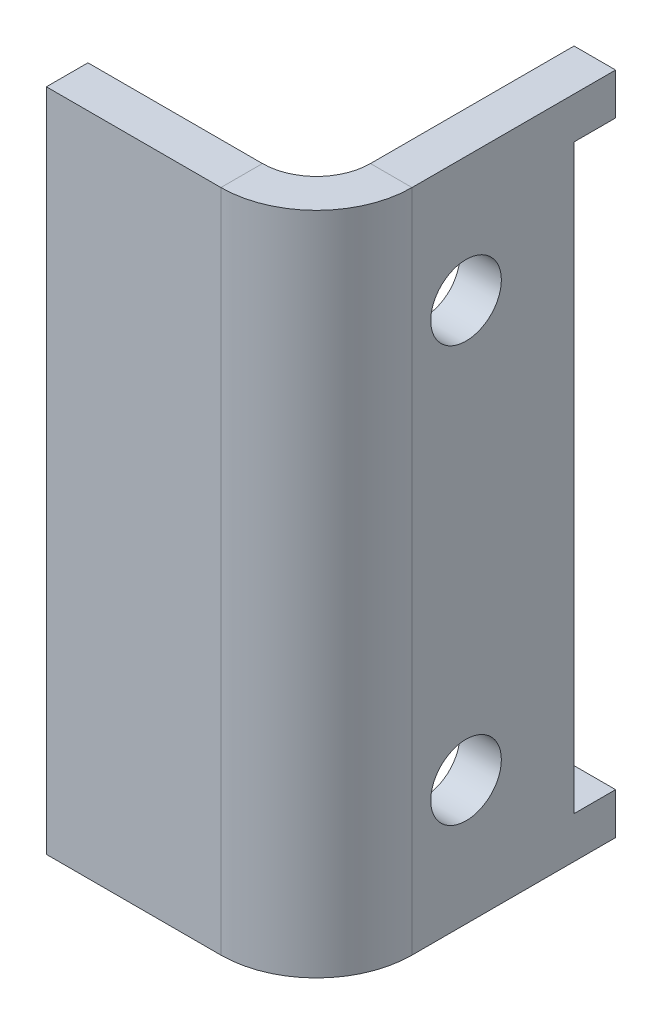
ISO-10303-21;
HEADER;
FILE_DESCRIPTION(('STEP AP214'),'2;1');
FILE_NAME('part.step','',(''),(''),'','','');
FILE_SCHEMA(('AUTOMOTIVE_DESIGN { 1 0 10303 214 1 1 1 1 }'));
ENDSEC;
DATA;
#1=APPLICATION_CONTEXT('core data for automotive mechanical design processes');
#2=APPLICATION_PROTOCOL_DEFINITION('international standard','automotive_design',2000,#1);
#3=PRODUCT_CONTEXT('',#1,'mechanical');
#4=PRODUCT('Part','Part','',(#3));
#5=PRODUCT_RELATED_PRODUCT_CATEGORY('part','',(#4));
#6=PRODUCT_DEFINITION_FORMATION('','',#4);
#7=PRODUCT_DEFINITION_CONTEXT('part definition',#1,'design');
#8=PRODUCT_DEFINITION('design','',#6,#7);
#9=PRODUCT_DEFINITION_SHAPE('','',#8);
#10=(LENGTH_UNIT() NAMED_UNIT(*) SI_UNIT(.MILLI.,.METRE.));
#11=(NAMED_UNIT(*) PLANE_ANGLE_UNIT() SI_UNIT($,.RADIAN.));
#12=(NAMED_UNIT(*) SI_UNIT($,.STERADIAN.) SOLID_ANGLE_UNIT());
#13=UNCERTAINTY_MEASURE_WITH_UNIT(LENGTH_MEASURE(1.E-05),#10,'distance_accuracy_value','');
#14=(GEOMETRIC_REPRESENTATION_CONTEXT(3) GLOBAL_UNCERTAINTY_ASSIGNED_CONTEXT((#13)) GLOBAL_UNIT_ASSIGNED_CONTEXT((#10,
#11,#12)) REPRESENTATION_CONTEXT('',''));
#15=CARTESIAN_POINT('',(0.,0.,0.));
#16=DIRECTION('',(0.,0.,1.));
#17=DIRECTION('',(1.,0.,0.));
#18=AXIS2_PLACEMENT_3D('',#15,#16,#17);
#19=CARTESIAN_POINT('',(0.,-80.,0.));
#20=DIRECTION('',(0.,1.,0.));
#21=DIRECTION('',(0.,0.,-1.));
#22=AXIS2_PLACEMENT_3D('',#19,#20,#21);
#23=PLANE('',#22);
#24=DIRECTION('',(1.,0.,0.));
#25=VECTOR('',#24,1.);
#26=CARTESIAN_POINT('',(0.,-80.,-23.));
#27=LINE('',#26,#25);
#28=CARTESIAN_POINT('',(-10.,-80.,-23.));
#29=VERTEX_POINT('',#28);
#30=CARTESIAN_POINT('',(0.,-80.,-23.));
#31=VERTEX_POINT('',#30);
#32=EDGE_CURVE('E11',#29,#31,#27,.T.);
#33=ORIENTED_EDGE('',*,*,#32,.F.);
#34=DIRECTION('',(0.,0.,1.));
#35=VECTOR('',#34,1.);
#36=CARTESIAN_POINT('',(-10.,-80.,0.));
#37=LINE('',#36,#35);
#38=CARTESIAN_POINT('',(-10.,-80.,-72.));
#39=VERTEX_POINT('',#38);
#40=EDGE_CURVE('E147',#29,#39,#37,.F.);
#41=ORIENTED_EDGE('',*,*,#40,.T.);
#42=DIRECTION('',(1.,0.,0.));
#43=VECTOR('',#42,1.);
#44=CARTESIAN_POINT('',(0.,-80.,-72.));
#45=LINE('',#44,#43);
#46=CARTESIAN_POINT('',(0.,-80.,-72.));
#47=VERTEX_POINT('',#46);
#48=EDGE_CURVE('E54',#39,#47,#45,.T.);
#49=ORIENTED_EDGE('',*,*,#48,.T.);
#50=DIRECTION('',(0.,0.,-1.));
#51=VECTOR('',#50,1.);
#52=CARTESIAN_POINT('',(0.,-80.,0.));
#53=LINE('',#52,#51);
#54=EDGE_CURVE('E230',#31,#47,#53,.T.);
#55=ORIENTED_EDGE('',*,*,#54,.F.);
#56=EDGE_LOOP('',(#33,#41,#49,#55));
#57=FACE_BOUND('',#56,.T.);
#58=ADVANCED_FACE('F43',(#57),#23,.F.);
#59=CARTESIAN_POINT('',(0.,80.,-72.));
#60=DIRECTION('',(0.,0.,-1.));
#61=DIRECTION('',(0.,-1.,0.));
#62=AXIS2_PLACEMENT_3D('',#59,#60,#61);
#63=PLANE('',#62);
#64=ORIENTED_EDGE('',*,*,#48,.F.);
#65=DIRECTION('',(0.,1.,0.));
#66=VECTOR('',#65,1.);
#67=CARTESIAN_POINT('',(-10.,80.,-72.));
#68=LINE('',#67,#66);
#69=CARTESIAN_POINT('',(-10.,-70.,-72.));
#70=VERTEX_POINT('',#69);
#71=EDGE_CURVE('E182',#70,#39,#68,.F.);
#72=ORIENTED_EDGE('',*,*,#71,.F.);
#73=DIRECTION('',(1.,0.,0.));
#74=VECTOR('',#73,1.);
#75=CARTESIAN_POINT('',(0.,-70.,-72.));
#76=LINE('',#75,#74);
#77=CARTESIAN_POINT('',(0.,-70.,-72.));
#78=VERTEX_POINT('',#77);
#79=EDGE_CURVE('E221',#70,#78,#76,.T.);
#80=ORIENTED_EDGE('',*,*,#79,.T.);
#81=DIRECTION('',(0.,-1.,0.));
#82=VECTOR('',#81,1.);
#83=CARTESIAN_POINT('',(0.,80.,-72.));
#84=LINE('',#83,#82);
#85=EDGE_CURVE('E243',#78,#47,#84,.T.);
#86=ORIENTED_EDGE('',*,*,#85,.T.);
#87=EDGE_LOOP('',(#64,#72,#80,#86));
#88=FACE_BOUND('',#87,.T.);
#89=ADVANCED_FACE('F251',(#88),#63,.T.);
#90=CARTESIAN_POINT('',(0.,-70.,-72.));
#91=DIRECTION('',(0.,1.,0.));
#92=DIRECTION('',(0.,0.,-1.));
#93=AXIS2_PLACEMENT_3D('',#90,#91,#92);
#94=PLANE('',#93);
#95=ORIENTED_EDGE('',*,*,#79,.F.);
#96=DIRECTION('',(0.,0.,1.));
#97=VECTOR('',#96,1.);
#98=CARTESIAN_POINT('',(-10.,-70.,0.));
#99=LINE('',#98,#97);
#100=CARTESIAN_POINT('',(-10.,-70.,-62.));
#101=VERTEX_POINT('',#100);
#102=EDGE_CURVE('E178',#101,#70,#99,.F.);
#103=ORIENTED_EDGE('',*,*,#102,.F.);
#104=DIRECTION('',(1.,0.,0.));
#105=VECTOR('',#104,1.);
#106=CARTESIAN_POINT('',(0.,-70.,-62.));
#107=LINE('',#106,#105);
#108=CARTESIAN_POINT('',(0.,-70.,-62.));
#109=VERTEX_POINT('',#108);
#110=EDGE_CURVE('E217',#101,#109,#107,.T.);
#111=ORIENTED_EDGE('',*,*,#110,.T.);
#112=DIRECTION('',(0.,0.,-1.));
#113=VECTOR('',#112,1.);
#114=CARTESIAN_POINT('',(0.,-70.,-72.));
#115=LINE('',#114,#113);
#116=EDGE_CURVE('E253',#109,#78,#115,.T.);
#117=ORIENTED_EDGE('',*,*,#116,.T.);
#118=EDGE_LOOP('',(#95,#103,#111,#117));
#119=FACE_BOUND('',#118,.T.);
#120=ADVANCED_FACE('F377',(#119),#94,.T.);
#121=CARTESIAN_POINT('',(0.,70.,-62.));
#122=DIRECTION('',(0.,0.,-1.));
#123=DIRECTION('',(0.,-1.,0.));
#124=AXIS2_PLACEMENT_3D('',#121,#122,#123);
#125=PLANE('',#124);
#126=ORIENTED_EDGE('',*,*,#110,.F.);
#127=DIRECTION('',(0.,1.,0.));
#128=VECTOR('',#127,1.);
#129=CARTESIAN_POINT('',(-10.,80.,-62.));
#130=LINE('',#129,#128);
#131=CARTESIAN_POINT('',(-10.,70.,-62.));
#132=VERTEX_POINT('',#131);
#133=EDGE_CURVE('E174',#132,#101,#130,.F.);
#134=ORIENTED_EDGE('',*,*,#133,.F.);
#135=DIRECTION('',(1.,0.,0.));
#136=VECTOR('',#135,1.);
#137=CARTESIAN_POINT('',(0.,70.,-62.));
#138=LINE('',#137,#136);
#139=CARTESIAN_POINT('',(0.,70.,-62.));
#140=VERTEX_POINT('',#139);
#141=EDGE_CURVE('E213',#132,#140,#138,.T.);
#142=ORIENTED_EDGE('',*,*,#141,.T.);
#143=DIRECTION('',(0.,-1.,0.));
#144=VECTOR('',#143,1.);
#145=CARTESIAN_POINT('',(0.,70.,-62.));
#146=LINE('',#145,#144);
#147=EDGE_CURVE('E260',#140,#109,#146,.T.);
#148=ORIENTED_EDGE('',*,*,#147,.T.);
#149=EDGE_LOOP('',(#126,#134,#142,#148));
#150=FACE_BOUND('',#149,.T.);
#151=ADVANCED_FACE('F343',(#150),#125,.T.);
#152=CARTESIAN_POINT('',(0.,70.,-72.));
#153=DIRECTION('',(0.,-1.,0.));
#154=DIRECTION('',(0.,0.,1.));
#155=AXIS2_PLACEMENT_3D('',#152,#153,#154);
#156=PLANE('',#155);
#157=ORIENTED_EDGE('',*,*,#141,.F.);
#158=DIRECTION('',(0.,0.,1.));
#159=VECTOR('',#158,1.);
#160=CARTESIAN_POINT('',(-10.,70.,0.));
#161=LINE('',#160,#159);
#162=CARTESIAN_POINT('',(-10.,70.,-72.));
#163=VERTEX_POINT('',#162);
#164=EDGE_CURVE('E170',#163,#132,#161,.T.);
#165=ORIENTED_EDGE('',*,*,#164,.F.);
#166=DIRECTION('',(1.,0.,0.));
#167=VECTOR('',#166,1.);
#168=CARTESIAN_POINT('',(0.,70.,-72.));
#169=LINE('',#168,#167);
#170=CARTESIAN_POINT('',(0.,70.,-72.));
#171=VERTEX_POINT('',#170);
#172=EDGE_CURVE('E209',#163,#171,#169,.T.);
#173=ORIENTED_EDGE('',*,*,#172,.T.);
#174=DIRECTION('',(0.,0.,1.));
#175=VECTOR('',#174,1.);
#176=CARTESIAN_POINT('',(0.,70.,-72.));
#177=LINE('',#176,#175);
#178=EDGE_CURVE('E267',#171,#140,#177,.T.);
#179=ORIENTED_EDGE('',*,*,#178,.T.);
#180=EDGE_LOOP('',(#157,#165,#173,#179));
#181=FACE_BOUND('',#180,.T.);
#182=ADVANCED_FACE('F337',(#181),#156,.T.);
#183=ORIENTED_EDGE('',*,*,#172,.F.);
#184=DIRECTION('',(0.,1.,0.));
#185=VECTOR('',#184,1.);
#186=CARTESIAN_POINT('',(-10.,80.,-72.));
#187=LINE('',#186,#185);
#188=CARTESIAN_POINT('',(-10.,80.,-72.));
#189=VERTEX_POINT('',#188);
#190=EDGE_CURVE('E166',#189,#163,#187,.F.);
#191=ORIENTED_EDGE('',*,*,#190,.F.);
#192=DIRECTION('',(1.,0.,0.));
#193=VECTOR('',#192,1.);
#194=CARTESIAN_POINT('',(0.,80.,-72.));
#195=LINE('',#194,#193);
#196=CARTESIAN_POINT('',(0.,80.,-72.));
#197=VERTEX_POINT('',#196);
#198=EDGE_CURVE('E205',#189,#197,#195,.T.);
#199=ORIENTED_EDGE('',*,*,#198,.T.);
#200=EDGE_CURVE('E256',#197,#171,#84,.T.);
#201=ORIENTED_EDGE('',*,*,#200,.T.);
#202=EDGE_LOOP('',(#183,#191,#199,#201));
#203=FACE_BOUND('',#202,.T.);
#204=ADVANCED_FACE('F336',(#203),#63,.T.);
#205=CARTESIAN_POINT('',(0.,80.,0.));
#206=DIRECTION('',(0.,1.,0.));
#207=DIRECTION('',(0.,0.,-1.));
#208=AXIS2_PLACEMENT_3D('',#205,#206,#207);
#209=PLANE('',#208);
#210=ORIENTED_EDGE('',*,*,#198,.F.);
#211=DIRECTION('',(0.,0.,1.));
#212=VECTOR('',#211,1.);
#213=CARTESIAN_POINT('',(-10.,80.,0.));
#214=LINE('',#213,#212);
#215=CARTESIAN_POINT('',(-10.,80.,-23.));
#216=VERTEX_POINT('',#215);
#217=EDGE_CURVE('E154',#216,#189,#214,.F.);
#218=ORIENTED_EDGE('',*,*,#217,.F.);
#219=DIRECTION('',(1.,0.,0.));
#220=VECTOR('',#219,1.);
#221=CARTESIAN_POINT('',(0.,80.,-23.));
#222=LINE('',#221,#220);
#223=CARTESIAN_POINT('',(0.,80.,-23.));
#224=VERTEX_POINT('',#223);
#225=EDGE_CURVE('E201',#216,#224,#222,.T.);
#226=ORIENTED_EDGE('',*,*,#225,.T.);
#227=DIRECTION('',(0.,0.,-1.));
#228=VECTOR('',#227,1.);
#229=CARTESIAN_POINT('',(0.,80.,0.));
#230=LINE('',#229,#228);
#231=EDGE_CURVE('E249',#224,#197,#230,.T.);
#232=ORIENTED_EDGE('',*,*,#231,.T.);
#233=EDGE_LOOP('',(#210,#218,#226,#232));
#234=FACE_BOUND('',#233,.T.);
#235=ADVANCED_FACE('F370',(#234),#209,.T.);
#236=CARTESIAN_POINT('',(-23.,80.,-23.));
#237=DIRECTION('',(0.,-1.,0.));
#238=DIRECTION('',(0.,0.,-1.));
#239=AXIS2_PLACEMENT_3D('',#236,#237,#238);
#240=PLANE('',#239);
#241=ORIENTED_EDGE('',*,*,#225,.F.);
#242=CARTESIAN_POINT('',(-23.,80.,-23.));
#243=DIRECTION('',(0.,-1.,0.));
#244=DIRECTION('',(0.,0.,-1.));
#245=AXIS2_PLACEMENT_3D('',#242,#243,#244);
#246=CIRCLE('',#245,13.);
#247=CARTESIAN_POINT('',(-23.,80.,-10.));
#248=VERTEX_POINT('',#247);
#249=EDGE_CURVE('E142',#216,#248,#246,.T.);
#250=ORIENTED_EDGE('',*,*,#249,.T.);
#251=DIRECTION('',(0.,0.,1.));
#252=VECTOR('',#251,1.);
#253=CARTESIAN_POINT('',(-23.,80.,0.));
#254=LINE('',#253,#252);
#255=CARTESIAN_POINT('',(-23.,80.,0.));
#256=VERTEX_POINT('',#255);
#257=EDGE_CURVE('E62',#248,#256,#254,.T.);
#258=ORIENTED_EDGE('',*,*,#257,.T.);
#259=CARTESIAN_POINT('',(-23.,80.,-23.));
#260=DIRECTION('',(0.,1.,0.));
#261=DIRECTION('',(0.,0.,1.));
#262=AXIS2_PLACEMENT_3D('',#259,#260,#261);
#263=CIRCLE('',#262,23.);
#264=EDGE_CURVE('E303',#224,#256,#263,.F.);
#265=ORIENTED_EDGE('',*,*,#264,.F.);
#266=EDGE_LOOP('',(#241,#250,#258,#265));
#267=FACE_BOUND('',#266,.T.);
#268=ADVANCED_FACE('F363',(#267),#240,.F.);
#269=CARTESIAN_POINT('',(-65.,80.,0.));
#270=DIRECTION('',(0.,1.,0.));
#271=DIRECTION('',(1.,0.,0.));
#272=AXIS2_PLACEMENT_3D('',#269,#270,#271);
#273=PLANE('',#272);
#274=ORIENTED_EDGE('',*,*,#257,.F.);
#275=DIRECTION('',(-1.,0.,0.));
#276=VECTOR('',#275,1.);
#277=CARTESIAN_POINT('',(-65.,80.,-10.));
#278=LINE('',#277,#276);
#279=CARTESIAN_POINT('',(-65.,80.,-10.));
#280=VERTEX_POINT('',#279);
#281=EDGE_CURVE('E132',#280,#248,#278,.F.);
#282=ORIENTED_EDGE('',*,*,#281,.F.);
#283=DIRECTION('',(0.,0.,1.));
#284=VECTOR('',#283,1.);
#285=CARTESIAN_POINT('',(-65.,80.,0.));
#286=LINE('',#285,#284);
#287=CARTESIAN_POINT('',(-65.,80.,0.));
#288=VERTEX_POINT('',#287);
#289=EDGE_CURVE('E195',#280,#288,#286,.T.);
#290=ORIENTED_EDGE('',*,*,#289,.T.);
#291=DIRECTION('',(1.,0.,0.));
#292=VECTOR('',#291,1.);
#293=CARTESIAN_POINT('',(-65.,80.,0.));
#294=LINE('',#293,#292);
#295=EDGE_CURVE('E288',#288,#256,#294,.T.);
#296=ORIENTED_EDGE('',*,*,#295,.T.);
#297=EDGE_LOOP('',(#274,#282,#290,#296));
#298=FACE_BOUND('',#297,.T.);
#299=ADVANCED_FACE('F361',(#298),#273,.T.);
#300=CARTESIAN_POINT('',(-65.,80.,0.));
#301=DIRECTION('',(1.,0.,0.));
#302=DIRECTION('',(0.,-1.,0.));
#303=AXIS2_PLACEMENT_3D('',#300,#301,#302);
#304=PLANE('',#303);
#305=ORIENTED_EDGE('',*,*,#289,.F.);
#306=DIRECTION('',(0.,1.,0.));
#307=VECTOR('',#306,1.);
#308=CARTESIAN_POINT('',(-65.,80.,-10.));
#309=LINE('',#308,#307);
#310=CARTESIAN_POINT('',(-65.,-80.,-10.));
#311=VERTEX_POINT('',#310);
#312=EDGE_CURVE('E152',#280,#311,#309,.F.);
#313=ORIENTED_EDGE('',*,*,#312,.T.);
#314=DIRECTION('',(0.,0.,1.));
#315=VECTOR('',#314,1.);
#316=CARTESIAN_POINT('',(-65.,-80.,0.));
#317=LINE('',#316,#315);
#318=CARTESIAN_POINT('',(-65.,-80.,0.));
#319=VERTEX_POINT('',#318);
#320=EDGE_CURVE('E120',#311,#319,#317,.T.);
#321=ORIENTED_EDGE('',*,*,#320,.T.);
#322=DIRECTION('',(0.,-1.,0.));
#323=VECTOR('',#322,1.);
#324=CARTESIAN_POINT('',(-65.,80.,0.));
#325=LINE('',#324,#323);
#326=EDGE_CURVE('E292',#288,#319,#325,.T.);
#327=ORIENTED_EDGE('',*,*,#326,.F.);
#328=EDGE_LOOP('',(#305,#313,#321,#327));
#329=FACE_BOUND('',#328,.T.);
#330=ADVANCED_FACE('F359',(#329),#304,.F.);
#331=CARTESIAN_POINT('',(-65.,-80.,0.));
#332=DIRECTION('',(0.,1.,0.));
#333=DIRECTION('',(1.,0.,0.));
#334=AXIS2_PLACEMENT_3D('',#331,#332,#333);
#335=PLANE('',#334);
#336=ORIENTED_EDGE('',*,*,#320,.F.);
#337=DIRECTION('',(-1.,0.,0.));
#338=VECTOR('',#337,1.);
#339=CARTESIAN_POINT('',(-65.,-80.,-10.));
#340=LINE('',#339,#338);
#341=CARTESIAN_POINT('',(-23.,-80.,-10.));
#342=VERTEX_POINT('',#341);
#343=EDGE_CURVE('E129',#311,#342,#340,.F.);
#344=ORIENTED_EDGE('',*,*,#343,.T.);
#345=DIRECTION('',(0.,0.,1.));
#346=VECTOR('',#345,1.);
#347=CARTESIAN_POINT('',(-23.,-80.,0.));
#348=LINE('',#347,#346);
#349=CARTESIAN_POINT('',(-23.,-80.,0.));
#350=VERTEX_POINT('',#349);
#351=EDGE_CURVE('E47',#342,#350,#348,.T.);
#352=ORIENTED_EDGE('',*,*,#351,.T.);
#353=DIRECTION('',(1.,0.,0.));
#354=VECTOR('',#353,1.);
#355=CARTESIAN_POINT('',(-65.,-80.,0.));
#356=LINE('',#355,#354);
#357=EDGE_CURVE('E248',#319,#350,#356,.T.);
#358=ORIENTED_EDGE('',*,*,#357,.F.);
#359=EDGE_LOOP('',(#336,#344,#352,#358));
#360=FACE_BOUND('',#359,.T.);
#361=ADVANCED_FACE('F144',(#360),#335,.F.);
#362=CARTESIAN_POINT('',(0.,-50.,-36.));
#363=DIRECTION('',(1.,0.,0.));
#364=DIRECTION('',(0.,0.,-1.));
#365=AXIS2_PLACEMENT_3D('',#362,#363,#364);
#366=CYLINDRICAL_SURFACE('',#365,8.5);
#367=CARTESIAN_POINT('',(0.,-50.,-36.));
#368=DIRECTION('',(1.,0.,0.));
#369=DIRECTION('',(0.,0.,-1.));
#370=AXIS2_PLACEMENT_3D('',#367,#368,#369);
#371=CIRCLE('',#370,8.5);
#372=CARTESIAN_POINT('',(0.,-50.,-44.5));
#373=VERTEX_POINT('',#372);
#374=EDGE_CURVE('E263',#373,#373,#371,.T.);
#375=ORIENTED_EDGE('',*,*,#374,.T.);
#376=EDGE_LOOP('',(#375));
#377=FACE_BOUND('',#376,.T.);
#378=CARTESIAN_POINT('',(-10.,-50.,-36.));
#379=DIRECTION('',(1.,0.,0.));
#380=DIRECTION('',(0.,0.,-1.));
#381=AXIS2_PLACEMENT_3D('',#378,#379,#380);
#382=CIRCLE('',#381,8.5);
#383=CARTESIAN_POINT('',(-10.,-50.,-44.5));
#384=VERTEX_POINT('',#383);
#385=EDGE_CURVE('E162',#384,#384,#382,.T.);
#386=ORIENTED_EDGE('',*,*,#385,.F.);
#387=EDGE_LOOP('',(#386));
#388=FACE_BOUND('',#387,.T.);
#389=ADVANCED_FACE('F313',(#377,#388),#366,.F.);
#390=CARTESIAN_POINT('',(0.,50.,-36.));
#391=DIRECTION('',(1.,0.,0.));
#392=DIRECTION('',(0.,0.,-1.));
#393=AXIS2_PLACEMENT_3D('',#390,#391,#392);
#394=CYLINDRICAL_SURFACE('',#393,8.5);
#395=CARTESIAN_POINT('',(0.,50.,-36.));
#396=DIRECTION('',(1.,0.,0.));
#397=DIRECTION('',(0.,0.,-1.));
#398=AXIS2_PLACEMENT_3D('',#395,#396,#397);
#399=CIRCLE('',#398,8.5);
#400=CARTESIAN_POINT('',(0.,50.,-44.5));
#401=VERTEX_POINT('',#400);
#402=EDGE_CURVE('E254',#401,#401,#399,.T.);
#403=ORIENTED_EDGE('',*,*,#402,.T.);
#404=EDGE_LOOP('',(#403));
#405=FACE_BOUND('',#404,.T.);
#406=CARTESIAN_POINT('',(-10.,50.,-36.));
#407=DIRECTION('',(1.,0.,0.));
#408=DIRECTION('',(0.,0.,-1.));
#409=AXIS2_PLACEMENT_3D('',#406,#407,#408);
#410=CIRCLE('',#409,8.5);
#411=CARTESIAN_POINT('',(-10.,50.,-44.5));
#412=VERTEX_POINT('',#411);
#413=EDGE_CURVE('E185',#412,#412,#410,.T.);
#414=ORIENTED_EDGE('',*,*,#413,.F.);
#415=EDGE_LOOP('',(#414));
#416=FACE_BOUND('',#415,.T.);
#417=ADVANCED_FACE('F45',(#405,#416),#394,.F.);
#418=CARTESIAN_POINT('',(-23.,-80.,-23.));
#419=DIRECTION('',(0.,1.,0.));
#420=DIRECTION('',(0.,0.,1.));
#421=AXIS2_PLACEMENT_3D('',#418,#419,#420);
#422=PLANE('',#421);
#423=CARTESIAN_POINT('',(-23.,-80.,-23.));
#424=DIRECTION('',(0.,-1.,0.));
#425=DIRECTION('',(0.,0.,-1.));
#426=AXIS2_PLACEMENT_3D('',#423,#424,#425);
#427=CIRCLE('',#426,13.);
#428=EDGE_CURVE('E111',#342,#29,#427,.F.);
#429=ORIENTED_EDGE('',*,*,#428,.T.);
#430=ORIENTED_EDGE('',*,*,#32,.T.);
#431=CARTESIAN_POINT('',(-23.,-80.,-23.));
#432=DIRECTION('',(0.,-1.,0.));
#433=DIRECTION('',(0.,0.,-1.));
#434=AXIS2_PLACEMENT_3D('',#431,#432,#433);
#435=CIRCLE('',#434,23.);
#436=EDGE_CURVE('E113',#350,#31,#435,.F.);
#437=ORIENTED_EDGE('',*,*,#436,.F.);
#438=ORIENTED_EDGE('',*,*,#351,.F.);
#439=EDGE_LOOP('',(#429,#430,#437,#438));
#440=FACE_BOUND('',#439,.T.);
#441=ADVANCED_FACE('F109',(#440),#422,.F.);
#442=CARTESIAN_POINT('',(-65.,80.,0.));
#443=DIRECTION('',(0.,0.,-1.));
#444=DIRECTION('',(-1.,0.,0.));
#445=AXIS2_PLACEMENT_3D('',#442,#443,#444);
#446=PLANE('',#445);
#447=ORIENTED_EDGE('',*,*,#357,.T.);
#448=DIRECTION('',(0.,-1.,0.));
#449=VECTOR('',#448,1.);
#450=CARTESIAN_POINT('',(-23.,80.,0.));
#451=LINE('',#450,#449);
#452=EDGE_CURVE('E121',#350,#256,#451,.F.);
#453=ORIENTED_EDGE('',*,*,#452,.T.);
#454=ORIENTED_EDGE('',*,*,#295,.F.);
#455=ORIENTED_EDGE('',*,*,#326,.T.);
#456=EDGE_LOOP('',(#447,#453,#454,#455));
#457=FACE_BOUND('',#456,.T.);
#458=ADVANCED_FACE('F319',(#457),#446,.F.);
#459=CARTESIAN_POINT('',(0.,80.,0.));
#460=DIRECTION('',(-1.,0.,0.));
#461=DIRECTION('',(0.,0.,1.));
#462=AXIS2_PLACEMENT_3D('',#459,#460,#461);
#463=PLANE('',#462);
#464=ORIENTED_EDGE('',*,*,#374,.F.);
#465=EDGE_LOOP('',(#464));
#466=FACE_BOUND('',#465,.T.);
#467=ORIENTED_EDGE('',*,*,#402,.F.);
#468=EDGE_LOOP('',(#467));
#469=FACE_BOUND('',#468,.T.);
#470=ORIENTED_EDGE('',*,*,#231,.F.);
#471=DIRECTION('',(0.,-1.,0.));
#472=VECTOR('',#471,1.);
#473=CARTESIAN_POINT('',(0.,80.,-23.));
#474=LINE('',#473,#472);
#475=EDGE_CURVE('E246',#224,#31,#474,.T.);
#476=ORIENTED_EDGE('',*,*,#475,.T.);
#477=ORIENTED_EDGE('',*,*,#54,.T.);
#478=ORIENTED_EDGE('',*,*,#85,.F.);
#479=ORIENTED_EDGE('',*,*,#116,.F.);
#480=ORIENTED_EDGE('',*,*,#147,.F.);
#481=ORIENTED_EDGE('',*,*,#178,.F.);
#482=ORIENTED_EDGE('',*,*,#200,.F.);
#483=EDGE_LOOP('',(#470,#476,#477,#478,#479,#480,#481,#482));
#484=FACE_BOUND('',#483,.T.);
#485=ADVANCED_FACE('F241',(#466,#469,#484),#463,.F.);
#486=CARTESIAN_POINT('',(-23.,80.,-23.));
#487=DIRECTION('',(0.,-1.,0.));
#488=DIRECTION('',(0.,0.,-1.));
#489=AXIS2_PLACEMENT_3D('',#486,#487,#488);
#490=CYLINDRICAL_SURFACE('',#489,23.);
#491=ORIENTED_EDGE('',*,*,#264,.T.);
#492=ORIENTED_EDGE('',*,*,#452,.F.);
#493=ORIENTED_EDGE('',*,*,#436,.T.);
#494=ORIENTED_EDGE('',*,*,#475,.F.);
#495=EDGE_LOOP('',(#491,#492,#493,#494));
#496=FACE_BOUND('',#495,.T.);
#497=ADVANCED_FACE('F318',(#496),#490,.T.);
#498=CARTESIAN_POINT('',(-65.,80.,-10.));
#499=DIRECTION('',(0.,0.,-1.));
#500=DIRECTION('',(-1.,0.,0.));
#501=AXIS2_PLACEMENT_3D('',#498,#499,#500);
#502=PLANE('',#501);
#503=ORIENTED_EDGE('',*,*,#343,.F.);
#504=ORIENTED_EDGE('',*,*,#312,.F.);
#505=ORIENTED_EDGE('',*,*,#281,.T.);
#506=DIRECTION('',(0.,1.,0.));
#507=VECTOR('',#506,1.);
#508=CARTESIAN_POINT('',(-23.,80.,-10.));
#509=LINE('',#508,#507);
#510=EDGE_CURVE('E126',#342,#248,#509,.T.);
#511=ORIENTED_EDGE('',*,*,#510,.F.);
#512=EDGE_LOOP('',(#503,#504,#505,#511));
#513=FACE_BOUND('',#512,.T.);
#514=ADVANCED_FACE('F127',(#513),#502,.T.);
#515=CARTESIAN_POINT('',(-10.,80.,0.));
#516=DIRECTION('',(-1.,0.,0.));
#517=DIRECTION('',(0.,0.,1.));
#518=AXIS2_PLACEMENT_3D('',#515,#516,#517);
#519=PLANE('',#518);
#520=ORIENTED_EDGE('',*,*,#385,.T.);
#521=EDGE_LOOP('',(#520));
#522=FACE_BOUND('',#521,.T.);
#523=ORIENTED_EDGE('',*,*,#413,.T.);
#524=EDGE_LOOP('',(#523));
#525=FACE_BOUND('',#524,.T.);
#526=ORIENTED_EDGE('',*,*,#217,.T.);
#527=ORIENTED_EDGE('',*,*,#190,.T.);
#528=ORIENTED_EDGE('',*,*,#164,.T.);
#529=ORIENTED_EDGE('',*,*,#133,.T.);
#530=ORIENTED_EDGE('',*,*,#102,.T.);
#531=ORIENTED_EDGE('',*,*,#71,.T.);
#532=ORIENTED_EDGE('',*,*,#40,.F.);
#533=DIRECTION('',(0.,1.,0.));
#534=VECTOR('',#533,1.);
#535=CARTESIAN_POINT('',(-10.,80.,-23.));
#536=LINE('',#535,#534);
#537=EDGE_CURVE('E136',#216,#29,#536,.F.);
#538=ORIENTED_EDGE('',*,*,#537,.F.);
#539=EDGE_LOOP('',(#526,#527,#528,#529,#530,#531,#532,#538));
#540=FACE_BOUND('',#539,.T.);
#541=ADVANCED_FACE('F327',(#522,#525,#540),#519,.T.);
#542=CARTESIAN_POINT('',(-23.,80.,-23.));
#543=DIRECTION('',(0.,-1.,0.));
#544=DIRECTION('',(0.,0.,-1.));
#545=AXIS2_PLACEMENT_3D('',#542,#543,#544);
#546=CYLINDRICAL_SURFACE('',#545,13.);
#547=ORIENTED_EDGE('',*,*,#249,.F.);
#548=ORIENTED_EDGE('',*,*,#537,.T.);
#549=ORIENTED_EDGE('',*,*,#428,.F.);
#550=ORIENTED_EDGE('',*,*,#510,.T.);
#551=EDGE_LOOP('',(#547,#548,#549,#550));
#552=FACE_BOUND('',#551,.T.);
#553=ADVANCED_FACE('F138',(#552),#546,.F.);
#554=CLOSED_SHELL('',(#58,#89,#120,#151,#182,#204,#235,#268,#299,#330,#361,#389,#417,#441,#458,
#485,#497,#514,#541,#553));
#555=MANIFOLD_SOLID_BREP('B2',#554);
#556=ADVANCED_BREP_SHAPE_REPRESENTATION('',(#18,#555),#14);
#557=SHAPE_DEFINITION_REPRESENTATION(#9,#556);
ENDSEC;
END-ISO-10303-21;
